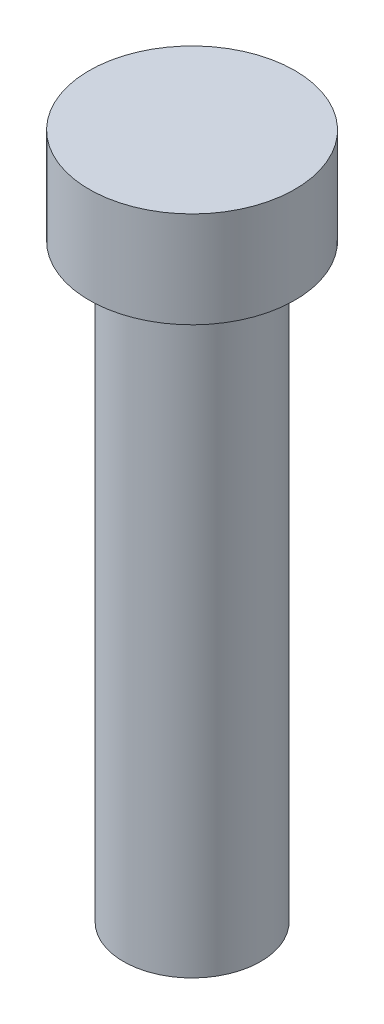
ISO-10303-21;
HEADER;
FILE_DESCRIPTION(('STEP AP214'),'2;1');
FILE_NAME('part.step','',(''),(''),'','','');
FILE_SCHEMA(('AUTOMOTIVE_DESIGN { 1 0 10303 214 1 1 1 1 }'));
ENDSEC;
DATA;
#1=APPLICATION_CONTEXT('core data for automotive mechanical design processes');
#2=APPLICATION_PROTOCOL_DEFINITION('international standard','automotive_design',2000,#1);
#3=PRODUCT_CONTEXT('',#1,'mechanical');
#4=PRODUCT('Part','Part','',(#3));
#5=PRODUCT_RELATED_PRODUCT_CATEGORY('part','',(#4));
#6=PRODUCT_DEFINITION_FORMATION('','',#4);
#7=PRODUCT_DEFINITION_CONTEXT('part definition',#1,'design');
#8=PRODUCT_DEFINITION('design','',#6,#7);
#9=PRODUCT_DEFINITION_SHAPE('','',#8);
#10=(LENGTH_UNIT() NAMED_UNIT(*) SI_UNIT(.MILLI.,.METRE.));
#11=(NAMED_UNIT(*) PLANE_ANGLE_UNIT() SI_UNIT($,.RADIAN.));
#12=(NAMED_UNIT(*) SI_UNIT($,.STERADIAN.) SOLID_ANGLE_UNIT());
#13=UNCERTAINTY_MEASURE_WITH_UNIT(LENGTH_MEASURE(1.E-05),#10,'distance_accuracy_value','');
#14=(GEOMETRIC_REPRESENTATION_CONTEXT(3) GLOBAL_UNCERTAINTY_ASSIGNED_CONTEXT((#13)) GLOBAL_UNIT_ASSIGNED_CONTEXT((#10,
#11,#12)) REPRESENTATION_CONTEXT('',''));
#15=CARTESIAN_POINT('',(0.,0.,0.));
#16=DIRECTION('',(0.,0.,1.));
#17=DIRECTION('',(1.,0.,0.));
#18=AXIS2_PLACEMENT_3D('',#15,#16,#17);
#19=CARTESIAN_POINT('',(5.,0.,0.));
#20=DIRECTION('',(0.,-1.,0.));
#21=DIRECTION('',(0.,0.,-1.));
#22=AXIS2_PLACEMENT_3D('',#19,#20,#21);
#23=PLANE('',#22);
#24=CARTESIAN_POINT('',(0.,0.,0.));
#25=DIRECTION('',(0.,-1.,0.));
#26=DIRECTION('',(0.,0.,-1.));
#27=AXIS2_PLACEMENT_3D('',#24,#25,#26);
#28=CIRCLE('',#27,5.);
#29=CARTESIAN_POINT('',(0.,0.,-5.));
#30=VERTEX_POINT('',#29);
#31=EDGE_CURVE('E49',#30,#30,#28,.T.);
#32=ORIENTED_EDGE('',*,*,#31,.T.);
#33=EDGE_LOOP('',(#32));
#34=FACE_BOUND('',#33,.T.);
#35=ADVANCED_FACE('F35',(#34),#23,.T.);
#36=CARTESIAN_POINT('',(7.5,50.,0.));
#37=DIRECTION('',(0.,1.,0.));
#38=DIRECTION('',(0.,0.,1.));
#39=AXIS2_PLACEMENT_3D('',#36,#37,#38);
#40=PLANE('',#39);
#41=CARTESIAN_POINT('',(0.,50.,0.));
#42=DIRECTION('',(0.,-1.,0.));
#43=DIRECTION('',(0.,0.,-1.));
#44=AXIS2_PLACEMENT_3D('',#41,#42,#43);
#45=CIRCLE('',#44,7.5);
#46=CARTESIAN_POINT('',(0.,50.,-7.5));
#47=VERTEX_POINT('',#46);
#48=EDGE_CURVE('E10',#47,#47,#45,.T.);
#49=ORIENTED_EDGE('',*,*,#48,.F.);
#50=EDGE_LOOP('',(#49));
#51=FACE_BOUND('',#50,.T.);
#52=ADVANCED_FACE('F67',(#51),#40,.T.);
#53=CARTESIAN_POINT('',(0.,0.,0.));
#54=DIRECTION('',(0.,-1.,0.));
#55=DIRECTION('',(0.,0.,-1.));
#56=AXIS2_PLACEMENT_3D('',#53,#54,#55);
#57=CYLINDRICAL_SURFACE('',#56,7.5);
#58=ORIENTED_EDGE('',*,*,#48,.T.);
#59=EDGE_LOOP('',(#58));
#60=FACE_BOUND('',#59,.T.);
#61=CARTESIAN_POINT('',(0.,43.,0.));
#62=DIRECTION('',(0.,-1.,0.));
#63=DIRECTION('',(0.,0.,-1.));
#64=AXIS2_PLACEMENT_3D('',#61,#62,#63);
#65=CIRCLE('',#64,7.5);
#66=CARTESIAN_POINT('',(0.,43.,-7.5));
#67=VERTEX_POINT('',#66);
#68=EDGE_CURVE('E41',#67,#67,#65,.T.);
#69=ORIENTED_EDGE('',*,*,#68,.F.);
#70=EDGE_LOOP('',(#69));
#71=FACE_BOUND('',#70,.T.);
#72=ADVANCED_FACE('F64',(#60,#71),#57,.T.);
#73=CARTESIAN_POINT('',(5.,43.,0.));
#74=DIRECTION('',(0.,-1.,0.));
#75=DIRECTION('',(0.,0.,-1.));
#76=AXIS2_PLACEMENT_3D('',#73,#74,#75);
#77=PLANE('',#76);
#78=ORIENTED_EDGE('',*,*,#68,.T.);
#79=EDGE_LOOP('',(#78));
#80=FACE_BOUND('',#79,.T.);
#81=CARTESIAN_POINT('',(0.,43.,0.));
#82=DIRECTION('',(0.,-1.,0.));
#83=DIRECTION('',(0.,0.,-1.));
#84=AXIS2_PLACEMENT_3D('',#81,#82,#83);
#85=CIRCLE('',#84,5.);
#86=CARTESIAN_POINT('',(0.,43.,-5.));
#87=VERTEX_POINT('',#86);
#88=EDGE_CURVE('E45',#87,#87,#85,.T.);
#89=ORIENTED_EDGE('',*,*,#88,.F.);
#90=EDGE_LOOP('',(#89));
#91=FACE_BOUND('',#90,.T.);
#92=ADVANCED_FACE('F58',(#80,#91),#77,.T.);
#93=CARTESIAN_POINT('',(0.,0.,0.));
#94=DIRECTION('',(0.,-1.,0.));
#95=DIRECTION('',(0.,0.,-1.));
#96=AXIS2_PLACEMENT_3D('',#93,#94,#95);
#97=CYLINDRICAL_SURFACE('',#96,5.);
#98=ORIENTED_EDGE('',*,*,#88,.T.);
#99=EDGE_LOOP('',(#98));
#100=FACE_BOUND('',#99,.T.);
#101=ORIENTED_EDGE('',*,*,#31,.F.);
#102=EDGE_LOOP('',(#101));
#103=FACE_BOUND('',#102,.T.);
#104=ADVANCED_FACE('F56',(#100,#103),#97,.T.);
#105=CLOSED_SHELL('',(#35,#52,#72,#92,#104));
#106=MANIFOLD_SOLID_BREP('B2',#105);
#107=ADVANCED_BREP_SHAPE_REPRESENTATION('',(#18,#106),#14);
#108=SHAPE_DEFINITION_REPRESENTATION(#9,#107);
ENDSEC;
END-ISO-10303-21;
